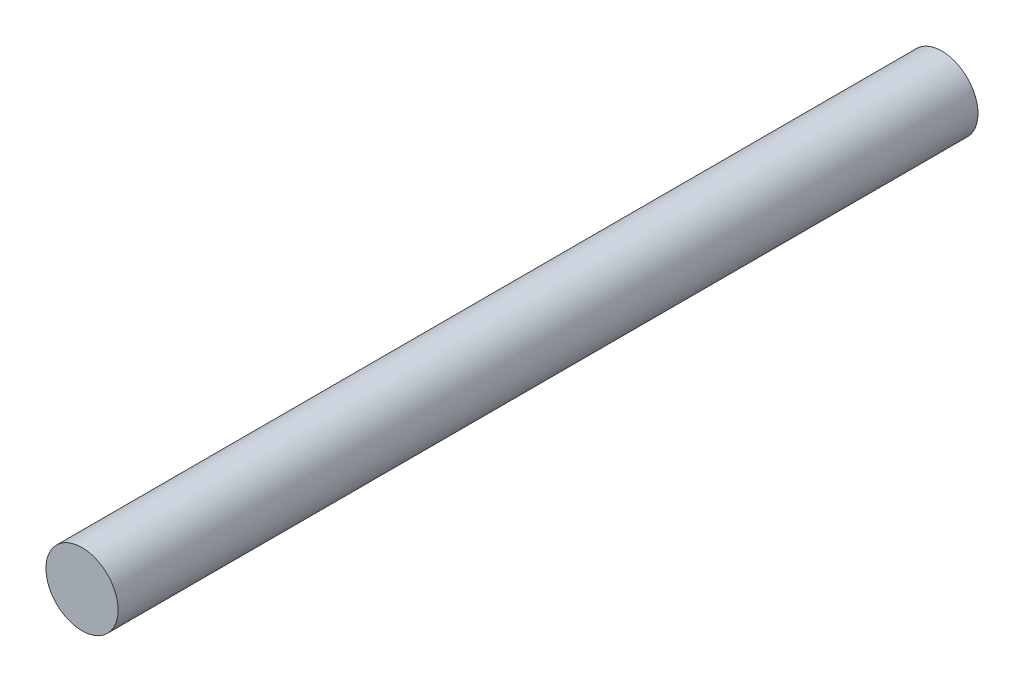
ISO-10303-21;
HEADER;
FILE_DESCRIPTION(('STEP AP214'),'2;1');
FILE_NAME('part.step','',(''),(''),'','','');
FILE_SCHEMA(('AUTOMOTIVE_DESIGN { 1 0 10303 214 1 1 1 1 }'));
ENDSEC;
DATA;
#1=APPLICATION_CONTEXT('core data for automotive mechanical design processes');
#2=APPLICATION_PROTOCOL_DEFINITION('international standard','automotive_design',2000,#1);
#3=PRODUCT_CONTEXT('',#1,'mechanical');
#4=PRODUCT('Part','Part','',(#3));
#5=PRODUCT_RELATED_PRODUCT_CATEGORY('part','',(#4));
#6=PRODUCT_DEFINITION_FORMATION('','',#4);
#7=PRODUCT_DEFINITION_CONTEXT('part definition',#1,'design');
#8=PRODUCT_DEFINITION('design','',#6,#7);
#9=PRODUCT_DEFINITION_SHAPE('','',#8);
#10=(LENGTH_UNIT() NAMED_UNIT(*) SI_UNIT(.MILLI.,.METRE.));
#11=(NAMED_UNIT(*) PLANE_ANGLE_UNIT() SI_UNIT($,.RADIAN.));
#12=(NAMED_UNIT(*) SI_UNIT($,.STERADIAN.) SOLID_ANGLE_UNIT());
#13=UNCERTAINTY_MEASURE_WITH_UNIT(LENGTH_MEASURE(1.E-05),#10,'distance_accuracy_value','');
#14=(GEOMETRIC_REPRESENTATION_CONTEXT(3) GLOBAL_UNCERTAINTY_ASSIGNED_CONTEXT((#13)) GLOBAL_UNIT_ASSIGNED_CONTEXT((#10,
#11,#12)) REPRESENTATION_CONTEXT('',''));
#15=CARTESIAN_POINT('',(0.,0.,0.));
#16=DIRECTION('',(0.,0.,1.));
#17=DIRECTION('',(1.,0.,0.));
#18=AXIS2_PLACEMENT_3D('',#15,#16,#17);
#19=CARTESIAN_POINT('',(0.,0.,101.6));
#20=DIRECTION('',(0.,0.,-1.));
#21=DIRECTION('',(-1.,0.,0.));
#22=AXIS2_PLACEMENT_3D('',#19,#20,#21);
#23=CYLINDRICAL_SURFACE('',#22,4.2625);
#24=CARTESIAN_POINT('',(0.,0.,101.6));
#25=DIRECTION('',(0.,0.,1.));
#26=DIRECTION('',(1.,0.,0.));
#27=AXIS2_PLACEMENT_3D('',#24,#25,#26);
#28=CIRCLE('',#27,4.2625);
#29=CARTESIAN_POINT('',(4.2625,0.,101.6));
#30=VERTEX_POINT('',#29);
#31=EDGE_CURVE('E10',#30,#30,#28,.T.);
#32=ORIENTED_EDGE('',*,*,#31,.F.);
#33=EDGE_LOOP('',(#32));
#34=FACE_BOUND('',#33,.T.);
#35=CARTESIAN_POINT('',(0.,0.,0.));
#36=DIRECTION('',(0.,0.,1.));
#37=DIRECTION('',(1.,0.,0.));
#38=AXIS2_PLACEMENT_3D('',#35,#36,#37);
#39=CIRCLE('',#38,4.2625);
#40=CARTESIAN_POINT('',(4.2625,0.,0.));
#41=VERTEX_POINT('',#40);
#42=EDGE_CURVE('E42',#41,#41,#39,.T.);
#43=ORIENTED_EDGE('',*,*,#42,.T.);
#44=EDGE_LOOP('',(#43));
#45=FACE_BOUND('',#44,.T.);
#46=ADVANCED_FACE('F39',(#34,#45),#23,.T.);
#47=CARTESIAN_POINT('',(0.,0.,101.6));
#48=DIRECTION('',(0.,0.,1.));
#49=DIRECTION('',(1.,0.,0.));
#50=AXIS2_PLACEMENT_3D('',#47,#48,#49);
#51=PLANE('',#50);
#52=ORIENTED_EDGE('',*,*,#31,.T.);
#53=EDGE_LOOP('',(#52));
#54=FACE_BOUND('',#53,.T.);
#55=ADVANCED_FACE('F54',(#54),#51,.T.);
#56=CARTESIAN_POINT('',(0.,0.,0.));
#57=DIRECTION('',(0.,0.,1.));
#58=DIRECTION('',(1.,0.,0.));
#59=AXIS2_PLACEMENT_3D('',#56,#57,#58);
#60=PLANE('',#59);
#61=ORIENTED_EDGE('',*,*,#42,.F.);
#62=EDGE_LOOP('',(#61));
#63=FACE_BOUND('',#62,.T.);
#64=ADVANCED_FACE('F52',(#63),#60,.F.);
#65=CLOSED_SHELL('',(#46,#55,#64));
#66=MANIFOLD_SOLID_BREP('B2',#65);
#67=ADVANCED_BREP_SHAPE_REPRESENTATION('',(#18,#66),#14);
#68=SHAPE_DEFINITION_REPRESENTATION(#9,#67);
ENDSEC;
END-ISO-10303-21;
